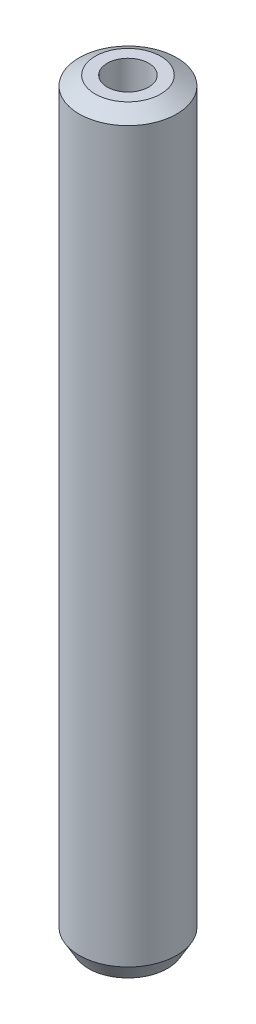
ISO-10303-21;
HEADER;
FILE_DESCRIPTION(('STEP AP214'),'2;1');
FILE_NAME('part.step','',(''),(''),'','','');
FILE_SCHEMA(('AUTOMOTIVE_DESIGN { 1 0 10303 214 1 1 1 1 }'));
ENDSEC;
DATA;
#1=APPLICATION_CONTEXT('core data for automotive mechanical design processes');
#2=APPLICATION_PROTOCOL_DEFINITION('international standard','automotive_design',2000,#1);
#3=PRODUCT_CONTEXT('',#1,'mechanical');
#4=PRODUCT('Part','Part','',(#3));
#5=PRODUCT_RELATED_PRODUCT_CATEGORY('part','',(#4));
#6=PRODUCT_DEFINITION_FORMATION('','',#4);
#7=PRODUCT_DEFINITION_CONTEXT('part definition',#1,'design');
#8=PRODUCT_DEFINITION('design','',#6,#7);
#9=PRODUCT_DEFINITION_SHAPE('','',#8);
#10=(LENGTH_UNIT() NAMED_UNIT(*) SI_UNIT(.MILLI.,.METRE.));
#11=(NAMED_UNIT(*) PLANE_ANGLE_UNIT() SI_UNIT($,.RADIAN.));
#12=(NAMED_UNIT(*) SI_UNIT($,.STERADIAN.) SOLID_ANGLE_UNIT());
#13=UNCERTAINTY_MEASURE_WITH_UNIT(LENGTH_MEASURE(1.E-05),#10,'distance_accuracy_value','');
#14=(GEOMETRIC_REPRESENTATION_CONTEXT(3) GLOBAL_UNCERTAINTY_ASSIGNED_CONTEXT((#13)) GLOBAL_UNIT_ASSIGNED_CONTEXT((#10,
#11,#12)) REPRESENTATION_CONTEXT('',''));
#15=CARTESIAN_POINT('',(0.,0.,0.));
#16=DIRECTION('',(0.,0.,1.));
#17=DIRECTION('',(1.,0.,0.));
#18=AXIS2_PLACEMENT_3D('',#15,#16,#17);
#19=CARTESIAN_POINT('',(0.,231.760429466409,0.));
#20=DIRECTION('',(0.,-1.,0.));
#21=DIRECTION('',(0.,0.,-1.));
#22=AXIS2_PLACEMENT_3D('',#19,#20,#21);
#23=CYLINDRICAL_SURFACE('',#22,15.);
#24=CARTESIAN_POINT('',(0.,228.912029463134,0.));
#25=DIRECTION('',(0.,1.,0.));
#26=DIRECTION('',(0.,0.,1.));
#27=AXIS2_PLACEMENT_3D('',#24,#25,#26);
#28=CIRCLE('',#27,15.);
#29=CARTESIAN_POINT('',(0.,228.912029463134,15.));
#30=VERTEX_POINT('',#29);
#31=EDGE_CURVE('E50',#30,#30,#28,.F.);
#32=ORIENTED_EDGE('',*,*,#31,.T.);
#33=EDGE_LOOP('',(#32));
#34=FACE_BOUND('',#33,.T.);
#35=CARTESIAN_POINT('',(0.,4.93357352595153,0.));
#36=DIRECTION('',(0.,1.,0.));
#37=DIRECTION('',(0.,0.,1.));
#38=AXIS2_PLACEMENT_3D('',#35,#36,#37);
#39=CIRCLE('',#38,15.);
#40=CARTESIAN_POINT('',(0.,4.93357352595153,15.));
#41=VERTEX_POINT('',#40);
#42=EDGE_CURVE('E51',#41,#41,#39,.T.);
#43=ORIENTED_EDGE('',*,*,#42,.T.);
#44=EDGE_LOOP('',(#43));
#45=FACE_BOUND('',#44,.T.);
#46=ADVANCED_FACE('F39',(#34,#45),#23,.T.);
#47=CARTESIAN_POINT('',(0.,231.760429466409,0.));
#48=DIRECTION('',(0.,1.,0.));
#49=DIRECTION('',(0.,0.,1.));
#50=AXIS2_PLACEMENT_3D('',#47,#48,#49);
#51=PLANE('',#50);
#52=CARTESIAN_POINT('',(0.,231.760429466409,0.));
#53=DIRECTION('',(0.,1.,0.));
#54=DIRECTION('',(0.,0.,1.));
#55=AXIS2_PLACEMENT_3D('',#52,#53,#54);
#56=CIRCLE('',#55,10.0664264740484);
#57=CARTESIAN_POINT('',(0.,231.760429466409,10.0664264740484));
#58=VERTEX_POINT('',#57);
#59=EDGE_CURVE('E54',#58,#58,#56,.T.);
#60=ORIENTED_EDGE('',*,*,#59,.T.);
#61=EDGE_LOOP('',(#60));
#62=FACE_BOUND('',#61,.T.);
#63=CARTESIAN_POINT('',(0.,231.760429466409,0.));
#64=DIRECTION('',(0.,1.,0.));
#65=DIRECTION('',(0.,0.,1.));
#66=AXIS2_PLACEMENT_3D('',#63,#64,#65);
#67=CIRCLE('',#66,6.36779096965993);
#68=CARTESIAN_POINT('',(0.,231.760429466409,6.36779096965993));
#69=VERTEX_POINT('',#68);
#70=EDGE_CURVE('E58',#69,#69,#67,.T.);
#71=ORIENTED_EDGE('',*,*,#70,.F.);
#72=EDGE_LOOP('',(#71));
#73=FACE_BOUND('',#72,.T.);
#74=ADVANCED_FACE('F69',(#62,#73),#51,.T.);
#75=CARTESIAN_POINT('',(0.,0.,0.));
#76=DIRECTION('',(0.,1.,0.));
#77=DIRECTION('',(0.,0.,1.));
#78=AXIS2_PLACEMENT_3D('',#75,#76,#77);
#79=PLANE('',#78);
#80=CARTESIAN_POINT('',(0.,0.,0.));
#81=DIRECTION('',(0.,1.,0.));
#82=DIRECTION('',(0.,0.,1.));
#83=AXIS2_PLACEMENT_3D('',#80,#81,#82);
#84=CIRCLE('',#83,12.1515999967251);
#85=CARTESIAN_POINT('',(0.,0.,12.1515999967251));
#86=VERTEX_POINT('',#85);
#87=EDGE_CURVE('E10',#86,#86,#84,.F.);
#88=ORIENTED_EDGE('',*,*,#87,.T.);
#89=EDGE_LOOP('',(#88));
#90=FACE_BOUND('',#89,.T.);
#91=CARTESIAN_POINT('',(0.,0.,0.));
#92=DIRECTION('',(0.,1.,0.));
#93=DIRECTION('',(0.,0.,1.));
#94=AXIS2_PLACEMENT_3D('',#91,#92,#93);
#95=CIRCLE('',#94,6.36779096965993);
#96=CARTESIAN_POINT('',(0.,0.,6.36779096965993));
#97=VERTEX_POINT('',#96);
#98=EDGE_CURVE('E63',#97,#97,#95,.T.);
#99=ORIENTED_EDGE('',*,*,#98,.T.);
#100=EDGE_LOOP('',(#99));
#101=FACE_BOUND('',#100,.T.);
#102=ADVANCED_FACE('F75',(#90,#101),#79,.F.);
#103=CARTESIAN_POINT('',(0.,231.760429466409,0.));
#104=DIRECTION('',(0.,-1.,0.));
#105=DIRECTION('',(0.,0.,-1.));
#106=AXIS2_PLACEMENT_3D('',#103,#104,#105);
#107=CYLINDRICAL_SURFACE('',#106,6.36779096965993);
#108=ORIENTED_EDGE('',*,*,#70,.T.);
#109=EDGE_LOOP('',(#108));
#110=FACE_BOUND('',#109,.T.);
#111=ORIENTED_EDGE('',*,*,#98,.F.);
#112=EDGE_LOOP('',(#111));
#113=FACE_BOUND('',#112,.T.);
#114=ADVANCED_FACE('F70',(#110,#113),#107,.F.);
#115=CARTESIAN_POINT('',(0.,231.760429466409,0.));
#116=DIRECTION('',(0.,-1.,0.));
#117=DIRECTION('',(0.,0.,-1.));
#118=AXIS2_PLACEMENT_3D('',#115,#116,#117);
#119=CONICAL_SURFACE('',#118,10.0664264740484,1.0471975511966);
#120=ORIENTED_EDGE('',*,*,#31,.F.);
#121=EDGE_LOOP('',(#120));
#122=FACE_BOUND('',#121,.T.);
#123=ORIENTED_EDGE('',*,*,#59,.F.);
#124=EDGE_LOOP('',(#123));
#125=FACE_BOUND('',#124,.T.);
#126=ADVANCED_FACE('F81',(#122,#125),#119,.T.);
#127=CARTESIAN_POINT('',(0.,4.93357352595153,0.));
#128=DIRECTION('',(0.,1.,0.));
#129=DIRECTION('',(0.,0.,1.));
#130=AXIS2_PLACEMENT_3D('',#127,#128,#129);
#131=CONICAL_SURFACE('',#130,15.,0.5235987755983);
#132=ORIENTED_EDGE('',*,*,#87,.F.);
#133=EDGE_LOOP('',(#132));
#134=FACE_BOUND('',#133,.T.);
#135=ORIENTED_EDGE('',*,*,#42,.F.);
#136=EDGE_LOOP('',(#135));
#137=FACE_BOUND('',#136,.T.);
#138=ADVANCED_FACE('F45',(#134,#137),#131,.T.);
#139=CLOSED_SHELL('',(#46,#74,#102,#114,#126,#138));
#140=MANIFOLD_SOLID_BREP('B2',#139);
#141=ADVANCED_BREP_SHAPE_REPRESENTATION('',(#18,#140),#14);
#142=SHAPE_DEFINITION_REPRESENTATION(#9,#141);
ENDSEC;
END-ISO-10303-21;
